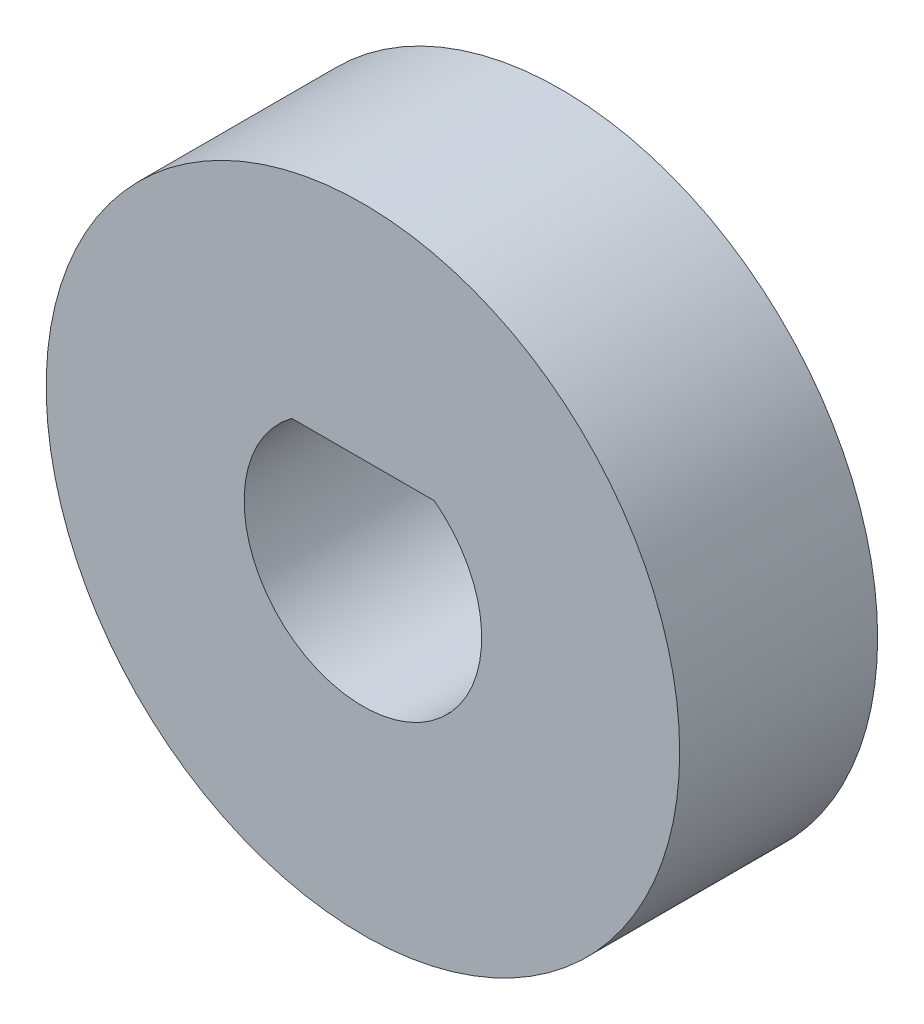
ISO-10303-21;
HEADER;
FILE_DESCRIPTION(('STEP AP214'),'2;1');
FILE_NAME('part.step','',(''),(''),'','','');
FILE_SCHEMA(('AUTOMOTIVE_DESIGN { 1 0 10303 214 1 1 1 1 }'));
ENDSEC;
DATA;
#1=APPLICATION_CONTEXT('core data for automotive mechanical design processes');
#2=APPLICATION_PROTOCOL_DEFINITION('international standard','automotive_design',2000,#1);
#3=PRODUCT_CONTEXT('',#1,'mechanical');
#4=PRODUCT('Part','Part','',(#3));
#5=PRODUCT_RELATED_PRODUCT_CATEGORY('part','',(#4));
#6=PRODUCT_DEFINITION_FORMATION('','',#4);
#7=PRODUCT_DEFINITION_CONTEXT('part definition',#1,'design');
#8=PRODUCT_DEFINITION('design','',#6,#7);
#9=PRODUCT_DEFINITION_SHAPE('','',#8);
#10=(LENGTH_UNIT() NAMED_UNIT(*) SI_UNIT(.MILLI.,.METRE.));
#11=(NAMED_UNIT(*) PLANE_ANGLE_UNIT() SI_UNIT($,.RADIAN.));
#12=(NAMED_UNIT(*) SI_UNIT($,.STERADIAN.) SOLID_ANGLE_UNIT());
#13=UNCERTAINTY_MEASURE_WITH_UNIT(LENGTH_MEASURE(1.E-05),#10,'distance_accuracy_value','');
#14=(GEOMETRIC_REPRESENTATION_CONTEXT(3) GLOBAL_UNCERTAINTY_ASSIGNED_CONTEXT((#13)) GLOBAL_UNIT_ASSIGNED_CONTEXT((#10,
#11,#12)) REPRESENTATION_CONTEXT('',''));
#15=CARTESIAN_POINT('',(0.,0.,0.));
#16=DIRECTION('',(0.,0.,1.));
#17=DIRECTION('',(1.,0.,0.));
#18=AXIS2_PLACEMENT_3D('',#15,#16,#17);
#19=CARTESIAN_POINT('',(0.,0.,5.));
#20=DIRECTION('',(0.,0.,-1.));
#21=DIRECTION('',(-1.,0.,0.));
#22=AXIS2_PLACEMENT_3D('',#19,#20,#21);
#23=CYLINDRICAL_SURFACE('',#22,3.);
#24=CARTESIAN_POINT('',(0.,0.,0.));
#25=DIRECTION('',(0.,0.,1.));
#26=DIRECTION('',(1.,0.,0.));
#27=AXIS2_PLACEMENT_3D('',#24,#25,#26);
#28=CIRCLE('',#27,3.);
#29=CARTESIAN_POINT('',(-1.8,2.4,0.));
#30=VERTEX_POINT('',#29);
#31=CARTESIAN_POINT('',(1.8,2.4,0.));
#32=VERTEX_POINT('',#31);
#33=EDGE_CURVE('E63',#30,#32,#28,.T.);
#34=ORIENTED_EDGE('',*,*,#33,.F.);
#35=DIRECTION('',(0.,0.,-1.));
#36=VECTOR('',#35,1.);
#37=CARTESIAN_POINT('',(-1.8,2.4,5.));
#38=LINE('',#37,#36);
#39=CARTESIAN_POINT('',(-1.8,2.4,5.));
#40=VERTEX_POINT('',#39);
#41=EDGE_CURVE('E11',#40,#30,#38,.T.);
#42=ORIENTED_EDGE('',*,*,#41,.F.);
#43=CARTESIAN_POINT('',(0.,0.,5.));
#44=DIRECTION('',(0.,0.,1.));
#45=DIRECTION('',(1.,0.,0.));
#46=AXIS2_PLACEMENT_3D('',#43,#44,#45);
#47=CIRCLE('',#46,3.);
#48=CARTESIAN_POINT('',(1.8,2.4,5.));
#49=VERTEX_POINT('',#48);
#50=EDGE_CURVE('E64',#40,#49,#47,.T.);
#51=ORIENTED_EDGE('',*,*,#50,.T.);
#52=DIRECTION('',(0.,0.,-1.));
#53=VECTOR('',#52,1.);
#54=CARTESIAN_POINT('',(1.8,2.4,5.));
#55=LINE('',#54,#53);
#56=EDGE_CURVE('E43',#49,#32,#55,.T.);
#57=ORIENTED_EDGE('',*,*,#56,.T.);
#58=EDGE_LOOP('',(#34,#42,#51,#57));
#59=FACE_BOUND('',#58,.T.);
#60=ADVANCED_FACE('F35',(#59),#23,.F.);
#61=CARTESIAN_POINT('',(0.,2.4,5.));
#62=DIRECTION('',(0.,1.,0.));
#63=DIRECTION('',(0.,0.,1.));
#64=AXIS2_PLACEMENT_3D('',#61,#62,#63);
#65=PLANE('',#64);
#66=DIRECTION('',(1.,0.,0.));
#67=VECTOR('',#66,1.);
#68=CARTESIAN_POINT('',(0.,2.4,0.));
#69=LINE('',#68,#67);
#70=EDGE_CURVE('E66',#30,#32,#69,.T.);
#71=ORIENTED_EDGE('',*,*,#70,.T.);
#72=ORIENTED_EDGE('',*,*,#56,.F.);
#73=DIRECTION('',(1.,0.,0.));
#74=VECTOR('',#73,1.);
#75=CARTESIAN_POINT('',(0.,2.4,5.));
#76=LINE('',#75,#74);
#77=EDGE_CURVE('E50',#40,#49,#76,.T.);
#78=ORIENTED_EDGE('',*,*,#77,.F.);
#79=ORIENTED_EDGE('',*,*,#41,.T.);
#80=EDGE_LOOP('',(#71,#72,#78,#79));
#81=FACE_BOUND('',#80,.T.);
#82=ADVANCED_FACE('F67',(#81),#65,.F.);
#83=CARTESIAN_POINT('',(0.,0.,5.));
#84=DIRECTION('',(0.,0.,-1.));
#85=DIRECTION('',(-1.,0.,0.));
#86=AXIS2_PLACEMENT_3D('',#83,#84,#85);
#87=CYLINDRICAL_SURFACE('',#86,8.);
#88=CARTESIAN_POINT('',(0.,0.,5.));
#89=DIRECTION('',(0.,0.,1.));
#90=DIRECTION('',(1.,0.,0.));
#91=AXIS2_PLACEMENT_3D('',#88,#89,#90);
#92=CIRCLE('',#91,8.);
#93=CARTESIAN_POINT('',(8.,0.,5.));
#94=VERTEX_POINT('',#93);
#95=EDGE_CURVE('E65',#94,#94,#92,.T.);
#96=ORIENTED_EDGE('',*,*,#95,.F.);
#97=EDGE_LOOP('',(#96));
#98=FACE_BOUND('',#97,.T.);
#99=CARTESIAN_POINT('',(0.,0.,0.));
#100=DIRECTION('',(0.,0.,1.));
#101=DIRECTION('',(1.,0.,0.));
#102=AXIS2_PLACEMENT_3D('',#99,#100,#101);
#103=CIRCLE('',#102,8.);
#104=CARTESIAN_POINT('',(8.,0.,0.));
#105=VERTEX_POINT('',#104);
#106=EDGE_CURVE('E69',#105,#105,#103,.T.);
#107=ORIENTED_EDGE('',*,*,#106,.T.);
#108=EDGE_LOOP('',(#107));
#109=FACE_BOUND('',#108,.T.);
#110=ADVANCED_FACE('F86',(#98,#109),#87,.T.);
#111=CARTESIAN_POINT('',(0.,0.,5.));
#112=DIRECTION('',(0.,0.,1.));
#113=DIRECTION('',(1.,0.,0.));
#114=AXIS2_PLACEMENT_3D('',#111,#112,#113);
#115=PLANE('',#114);
#116=ORIENTED_EDGE('',*,*,#50,.F.);
#117=ORIENTED_EDGE('',*,*,#77,.T.);
#118=EDGE_LOOP('',(#116,#117));
#119=FACE_BOUND('',#118,.T.);
#120=ORIENTED_EDGE('',*,*,#95,.T.);
#121=EDGE_LOOP('',(#120));
#122=FACE_BOUND('',#121,.T.);
#123=ADVANCED_FACE('F84',(#119,#122),#115,.T.);
#124=CARTESIAN_POINT('',(0.,0.,0.));
#125=DIRECTION('',(0.,0.,1.));
#126=DIRECTION('',(1.,0.,0.));
#127=AXIS2_PLACEMENT_3D('',#124,#125,#126);
#128=PLANE('',#127);
#129=ORIENTED_EDGE('',*,*,#33,.T.);
#130=ORIENTED_EDGE('',*,*,#70,.F.);
#131=EDGE_LOOP('',(#129,#130));
#132=FACE_BOUND('',#131,.T.);
#133=ORIENTED_EDGE('',*,*,#106,.F.);
#134=EDGE_LOOP('',(#133));
#135=FACE_BOUND('',#134,.T.);
#136=ADVANCED_FACE('F71',(#132,#135),#128,.F.);
#137=CLOSED_SHELL('',(#60,#82,#110,#123,#136));
#138=MANIFOLD_SOLID_BREP('B2',#137);
#139=ADVANCED_BREP_SHAPE_REPRESENTATION('',(#18,#138),#14);
#140=SHAPE_DEFINITION_REPRESENTATION(#9,#139);
ENDSEC;
END-ISO-10303-21;
